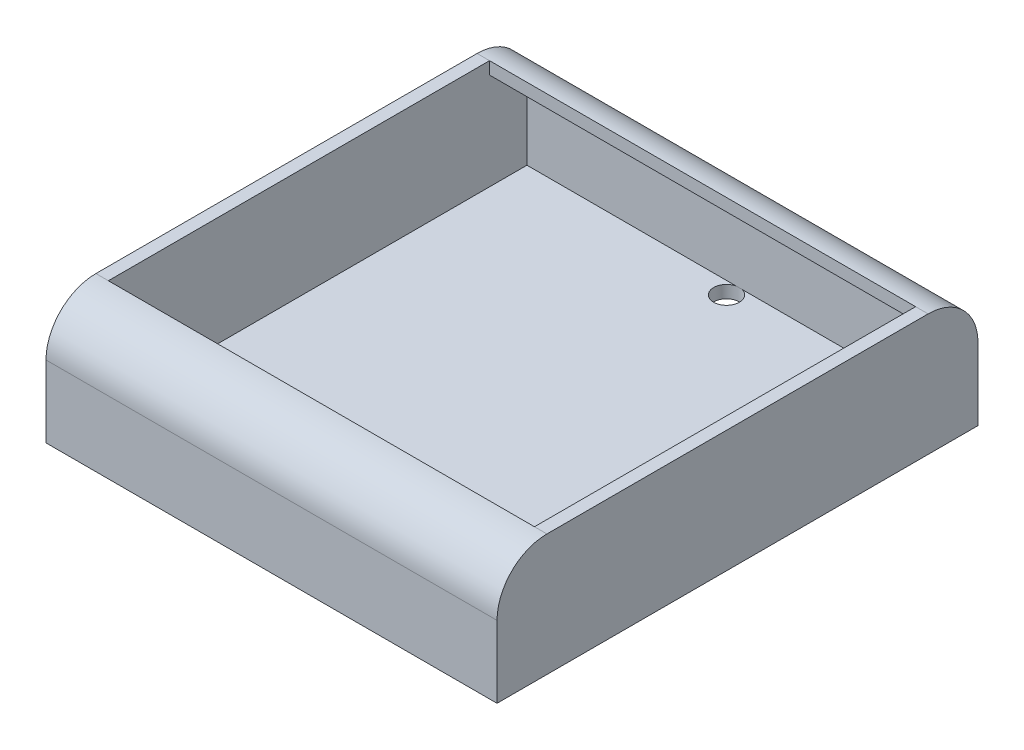
ISO-10303-21;
HEADER;
FILE_DESCRIPTION(('STEP AP214'),'2;1');
FILE_NAME('part.step','',(''),(''),'','','');
FILE_SCHEMA(('AUTOMOTIVE_DESIGN { 1 0 10303 214 1 1 1 1 }'));
ENDSEC;
DATA;
#1=APPLICATION_CONTEXT('core data for automotive mechanical design processes');
#2=APPLICATION_PROTOCOL_DEFINITION('international standard','automotive_design',2000,#1);
#3=PRODUCT_CONTEXT('',#1,'mechanical');
#4=PRODUCT('Part','Part','',(#3));
#5=PRODUCT_RELATED_PRODUCT_CATEGORY('part','',(#4));
#6=PRODUCT_DEFINITION_FORMATION('','',#4);
#7=PRODUCT_DEFINITION_CONTEXT('part definition',#1,'design');
#8=PRODUCT_DEFINITION('design','',#6,#7);
#9=PRODUCT_DEFINITION_SHAPE('','',#8);
#10=(LENGTH_UNIT() NAMED_UNIT(*) SI_UNIT(.MILLI.,.METRE.));
#11=(NAMED_UNIT(*) PLANE_ANGLE_UNIT() SI_UNIT($,.RADIAN.));
#12=(NAMED_UNIT(*) SI_UNIT($,.STERADIAN.) SOLID_ANGLE_UNIT());
#13=UNCERTAINTY_MEASURE_WITH_UNIT(LENGTH_MEASURE(1.E-05),#10,'distance_accuracy_value','');
#14=(GEOMETRIC_REPRESENTATION_CONTEXT(3) GLOBAL_UNCERTAINTY_ASSIGNED_CONTEXT((#13)) GLOBAL_UNIT_ASSIGNED_CONTEXT((#10,
#11,#12)) REPRESENTATION_CONTEXT('',''));
#15=CARTESIAN_POINT('',(0.,0.,0.));
#16=DIRECTION('',(0.,0.,1.));
#17=DIRECTION('',(1.,0.,0.));
#18=AXIS2_PLACEMENT_3D('',#15,#16,#17);
#19=CARTESIAN_POINT('',(0.,1.5875,0.));
#20=DIRECTION('',(0.,1.,0.));
#21=DIRECTION('',(0.,0.,1.));
#22=AXIS2_PLACEMENT_3D('',#19,#20,#21);
#23=PLANE('',#22);
#24=CARTESIAN_POINT('',(28.575,1.5875,58.039));
#25=DIRECTION('',(0.,1.,0.));
#26=DIRECTION('',(0.,0.,1.));
#27=AXIS2_PLACEMENT_3D('',#24,#25,#26);
#28=CIRCLE('',#27,1.63194999999999);
#29=CARTESIAN_POINT('',(28.9532916236185,1.5875,59.6265));
#30=VERTEX_POINT('',#29);
#31=CARTESIAN_POINT('',(28.1967083763815,1.5875,59.6265));
#32=VERTEX_POINT('',#31);
#33=EDGE_CURVE('E55',#30,#32,#28,.T.);
#34=ORIENTED_EDGE('',*,*,#33,.F.);
#35=DIRECTION('',(1.,0.,0.));
#36=VECTOR('',#35,1.);
#37=CARTESIAN_POINT('',(-15.2876826971912,1.5875,59.6265));
#38=LINE('',#37,#36);
#39=CARTESIAN_POINT('',(55.8165,1.5875,59.6265));
#40=VERTEX_POINT('',#39);
#41=EDGE_CURVE('E162',#30,#40,#38,.T.);
#42=ORIENTED_EDGE('',*,*,#41,.T.);
#43=DIRECTION('',(0.,0.,-1.));
#44=VECTOR('',#43,1.);
#45=CARTESIAN_POINT('',(55.8165,1.5875,61.214));
#46=LINE('',#45,#44);
#47=CARTESIAN_POINT('',(55.8165,1.5875,1.58750000000003));
#48=VERTEX_POINT('',#47);
#49=EDGE_CURVE('E217',#40,#48,#46,.T.);
#50=ORIENTED_EDGE('',*,*,#49,.T.);
#51=DIRECTION('',(1.,0.,0.));
#52=VECTOR('',#51,1.);
#53=CARTESIAN_POINT('',(-15.2876826971912,1.5875,1.58750000000001));
#54=LINE('',#53,#52);
#55=CARTESIAN_POINT('',(28.9532916236186,1.5875,1.5875));
#56=VERTEX_POINT('',#55);
#57=EDGE_CURVE('E207',#56,#48,#54,.T.);
#58=ORIENTED_EDGE('',*,*,#57,.F.);
#59=CARTESIAN_POINT('',(28.575,1.5875,3.175));
#60=DIRECTION('',(0.,1.,0.));
#61=DIRECTION('',(0.,0.,1.));
#62=AXIS2_PLACEMENT_3D('',#59,#60,#61);
#63=CIRCLE('',#62,1.63194999999999);
#64=CARTESIAN_POINT('',(28.1967083763815,1.5875,1.5875));
#65=VERTEX_POINT('',#64);
#66=EDGE_CURVE('E318',#65,#56,#63,.T.);
#67=ORIENTED_EDGE('',*,*,#66,.F.);
#68=CARTESIAN_POINT('',(1.5875,1.5875,1.58750000000001));
#69=VERTEX_POINT('',#68);
#70=EDGE_CURVE('E208',#69,#65,#54,.T.);
#71=ORIENTED_EDGE('',*,*,#70,.F.);
#72=DIRECTION('',(0.,0.,1.));
#73=VECTOR('',#72,1.);
#74=CARTESIAN_POINT('',(1.5875,1.5875,0.));
#75=LINE('',#74,#73);
#76=CARTESIAN_POINT('',(1.58750000000001,1.5875,59.6265));
#77=VERTEX_POINT('',#76);
#78=EDGE_CURVE('E290',#69,#77,#75,.T.);
#79=ORIENTED_EDGE('',*,*,#78,.T.);
#80=EDGE_CURVE('E161',#77,#32,#38,.T.);
#81=ORIENTED_EDGE('',*,*,#80,.T.);
#82=EDGE_LOOP('',(#34,#42,#50,#58,#67,#71,#79,#81));
#83=FACE_BOUND('',#82,.T.);
#84=ADVANCED_FACE('F41',(#83),#23,.T.);
#85=CARTESIAN_POINT('',(55.8165,9.144,54.864));
#86=DIRECTION('',(1.,0.,0.));
#87=DIRECTION('',(0.,0.,-1.));
#88=AXIS2_PLACEMENT_3D('',#85,#86,#87);
#89=PLANE('',#88);
#90=ORIENTED_EDGE('',*,*,#49,.F.);
#91=DIRECTION('',(0.,1.,0.));
#92=VECTOR('',#91,1.);
#93=CARTESIAN_POINT('',(55.8165,0.,59.6265));
#94=LINE('',#93,#92);
#95=CARTESIAN_POINT('',(55.8165,9.144,59.6265));
#96=VERTEX_POINT('',#95);
#97=EDGE_CURVE('E174',#40,#96,#94,.T.);
#98=ORIENTED_EDGE('',*,*,#97,.T.);
#99=CARTESIAN_POINT('',(55.8165,9.144,54.864));
#100=DIRECTION('',(-1.,0.,0.));
#101=DIRECTION('',(0.,0.,1.));
#102=AXIS2_PLACEMENT_3D('',#99,#100,#101);
#103=CIRCLE('',#102,4.7625);
#104=CARTESIAN_POINT('',(55.8165,13.9065,54.864));
#105=VERTEX_POINT('',#104);
#106=EDGE_CURVE('E291',#96,#105,#103,.T.);
#107=ORIENTED_EDGE('',*,*,#106,.T.);
#108=DIRECTION('',(0.,1.,0.));
#109=VECTOR('',#108,1.);
#110=CARTESIAN_POINT('',(55.8165,0.,54.864));
#111=LINE('',#110,#109);
#112=CARTESIAN_POINT('',(55.8165,15.494,54.864));
#113=VERTEX_POINT('',#112);
#114=EDGE_CURVE('E297',#105,#113,#111,.T.);
#115=ORIENTED_EDGE('',*,*,#114,.T.);
#116=DIRECTION('',(0.,0.,1.));
#117=VECTOR('',#116,1.);
#118=CARTESIAN_POINT('',(55.8165,15.494,54.864));
#119=LINE('',#118,#117);
#120=CARTESIAN_POINT('',(55.8165,15.494,6.34999999999999));
#121=VERTEX_POINT('',#120);
#122=EDGE_CURVE('E219',#121,#113,#119,.T.);
#123=ORIENTED_EDGE('',*,*,#122,.F.);
#124=DIRECTION('',(0.,1.,0.));
#125=VECTOR('',#124,1.);
#126=CARTESIAN_POINT('',(55.8165,1.24900090270336E-13,6.35000000000027));
#127=LINE('',#126,#125);
#128=CARTESIAN_POINT('',(55.8165,13.9065,6.34999999999999));
#129=VERTEX_POINT('',#128);
#130=EDGE_CURVE('E199',#129,#121,#127,.T.);
#131=ORIENTED_EDGE('',*,*,#130,.F.);
#132=CARTESIAN_POINT('',(55.8165,9.144,6.34999999999999));
#133=DIRECTION('',(-1.,0.,0.));
#134=DIRECTION('',(0.,0.,1.));
#135=AXIS2_PLACEMENT_3D('',#132,#133,#134);
#136=CIRCLE('',#135,4.7625);
#137=CARTESIAN_POINT('',(55.8165,9.144,1.58749999999999));
#138=VERTEX_POINT('',#137);
#139=EDGE_CURVE('E189',#129,#138,#136,.T.);
#140=ORIENTED_EDGE('',*,*,#139,.T.);
#141=DIRECTION('',(0.,-1.,0.));
#142=VECTOR('',#141,1.);
#143=CARTESIAN_POINT('',(55.8165,0.,1.58749999999998));
#144=LINE('',#143,#142);
#145=EDGE_CURVE('E202',#138,#48,#144,.T.);
#146=ORIENTED_EDGE('',*,*,#145,.T.);
#147=EDGE_LOOP('',(#90,#98,#107,#115,#123,#131,#140,#146));
#148=FACE_BOUND('',#147,.T.);
#149=ADVANCED_FACE('F312',(#148),#89,.F.);
#150=CARTESIAN_POINT('',(0.,1.5875,0.));
#151=DIRECTION('',(1.,0.,0.));
#152=DIRECTION('',(0.,0.,-1.));
#153=AXIS2_PLACEMENT_3D('',#150,#151,#152);
#154=PLANE('',#153);
#155=DIRECTION('',(0.,0.,1.));
#156=VECTOR('',#155,1.);
#157=CARTESIAN_POINT('',(0.,0.,0.));
#158=LINE('',#157,#156);
#159=CARTESIAN_POINT('',(0.,0.,0.));
#160=VERTEX_POINT('',#159);
#161=CARTESIAN_POINT('',(0.,0.,61.214));
#162=VERTEX_POINT('',#161);
#163=EDGE_CURVE('E234',#160,#162,#158,.T.);
#164=ORIENTED_EDGE('',*,*,#163,.T.);
#165=DIRECTION('',(0.,-1.,0.));
#166=VECTOR('',#165,1.);
#167=CARTESIAN_POINT('',(0.,1.5875,61.214));
#168=LINE('',#167,#166);
#169=CARTESIAN_POINT('',(0.,9.144,61.214));
#170=VERTEX_POINT('',#169);
#171=EDGE_CURVE('E12',#170,#162,#168,.T.);
#172=ORIENTED_EDGE('',*,*,#171,.F.);
#173=CARTESIAN_POINT('',(0.,9.144,54.864));
#174=DIRECTION('',(-1.,0.,0.));
#175=DIRECTION('',(0.,0.,1.));
#176=AXIS2_PLACEMENT_3D('',#173,#174,#175);
#177=CIRCLE('',#176,6.35);
#178=CARTESIAN_POINT('',(0.,15.494,54.864));
#179=VERTEX_POINT('',#178);
#180=EDGE_CURVE('E281',#170,#179,#177,.T.);
#181=ORIENTED_EDGE('',*,*,#180,.T.);
#182=DIRECTION('',(0.,0.,-1.));
#183=VECTOR('',#182,1.);
#184=CARTESIAN_POINT('',(0.,15.494,54.864));
#185=LINE('',#184,#183);
#186=CARTESIAN_POINT('',(0.,15.494,6.35));
#187=VERTEX_POINT('',#186);
#188=EDGE_CURVE('E273',#179,#187,#185,.T.);
#189=ORIENTED_EDGE('',*,*,#188,.T.);
#190=CARTESIAN_POINT('',(0.,9.144,6.35));
#191=DIRECTION('',(-1.,0.,0.));
#192=DIRECTION('',(0.,0.,1.));
#193=AXIS2_PLACEMENT_3D('',#190,#191,#192);
#194=CIRCLE('',#193,6.35);
#195=CARTESIAN_POINT('',(0.,9.144,0.));
#196=VERTEX_POINT('',#195);
#197=EDGE_CURVE('E271',#187,#196,#194,.T.);
#198=ORIENTED_EDGE('',*,*,#197,.T.);
#199=DIRECTION('',(0.,-1.,0.));
#200=VECTOR('',#199,1.);
#201=CARTESIAN_POINT('',(0.,1.5875,0.));
#202=LINE('',#201,#200);
#203=EDGE_CURVE('E249',#196,#160,#202,.T.);
#204=ORIENTED_EDGE('',*,*,#203,.T.);
#205=EDGE_LOOP('',(#164,#172,#181,#189,#198,#204));
#206=FACE_BOUND('',#205,.T.);
#207=ADVANCED_FACE('F43',(#206),#154,.F.);
#208=CARTESIAN_POINT('',(0.,1.5875,61.214));
#209=DIRECTION('',(0.,0.,-1.));
#210=DIRECTION('',(-1.,0.,0.));
#211=AXIS2_PLACEMENT_3D('',#208,#209,#210);
#212=PLANE('',#211);
#213=DIRECTION('',(1.,0.,0.));
#214=VECTOR('',#213,1.);
#215=CARTESIAN_POINT('',(0.,0.,61.214));
#216=LINE('',#215,#214);
#217=CARTESIAN_POINT('',(57.404,0.,61.214));
#218=VERTEX_POINT('',#217);
#219=EDGE_CURVE('E243',#162,#218,#216,.T.);
#220=ORIENTED_EDGE('',*,*,#219,.T.);
#221=DIRECTION('',(0.,-1.,0.));
#222=VECTOR('',#221,1.);
#223=CARTESIAN_POINT('',(57.404,1.5875,61.214));
#224=LINE('',#223,#222);
#225=CARTESIAN_POINT('',(57.404,9.144,61.214));
#226=VERTEX_POINT('',#225);
#227=EDGE_CURVE('E49',#226,#218,#224,.T.);
#228=ORIENTED_EDGE('',*,*,#227,.F.);
#229=DIRECTION('',(1.,0.,0.));
#230=VECTOR('',#229,1.);
#231=CARTESIAN_POINT('',(55.8165,9.144,61.214));
#232=LINE('',#231,#230);
#233=EDGE_CURVE('E231',#170,#226,#232,.T.);
#234=ORIENTED_EDGE('',*,*,#233,.F.);
#235=ORIENTED_EDGE('',*,*,#171,.T.);
#236=EDGE_LOOP('',(#220,#228,#234,#235));
#237=FACE_BOUND('',#236,.T.);
#238=ADVANCED_FACE('F348',(#237),#212,.F.);
#239=CARTESIAN_POINT('',(57.404,1.5875,0.));
#240=DIRECTION('',(-1.,0.,0.));
#241=DIRECTION('',(0.,0.,1.));
#242=AXIS2_PLACEMENT_3D('',#239,#240,#241);
#243=PLANE('',#242);
#244=DIRECTION('',(0.,0.,-1.));
#245=VECTOR('',#244,1.);
#246=CARTESIAN_POINT('',(57.404,0.,0.));
#247=LINE('',#246,#245);
#248=CARTESIAN_POINT('',(57.404,0.,0.));
#249=VERTEX_POINT('',#248);
#250=EDGE_CURVE('E245',#218,#249,#247,.T.);
#251=ORIENTED_EDGE('',*,*,#250,.T.);
#252=DIRECTION('',(0.,-1.,0.));
#253=VECTOR('',#252,1.);
#254=CARTESIAN_POINT('',(57.404,1.5875,0.));
#255=LINE('',#254,#253);
#256=CARTESIAN_POINT('',(57.404,9.144,0.));
#257=VERTEX_POINT('',#256);
#258=EDGE_CURVE('E252',#257,#249,#255,.T.);
#259=ORIENTED_EDGE('',*,*,#258,.F.);
#260=CARTESIAN_POINT('',(57.404,9.144,6.34999999999999));
#261=DIRECTION('',(1.,0.,0.));
#262=DIRECTION('',(0.,0.,1.));
#263=AXIS2_PLACEMENT_3D('',#260,#261,#262);
#264=CIRCLE('',#263,6.35);
#265=CARTESIAN_POINT('',(57.404,15.494,6.34999999999999));
#266=VERTEX_POINT('',#265);
#267=EDGE_CURVE('E216',#257,#266,#264,.T.);
#268=ORIENTED_EDGE('',*,*,#267,.T.);
#269=DIRECTION('',(0.,0.,1.));
#270=VECTOR('',#269,1.);
#271=CARTESIAN_POINT('',(57.404,15.494,54.864));
#272=LINE('',#271,#270);
#273=CARTESIAN_POINT('',(57.404,15.494,54.864));
#274=VERTEX_POINT('',#273);
#275=EDGE_CURVE('E226',#266,#274,#272,.T.);
#276=ORIENTED_EDGE('',*,*,#275,.T.);
#277=CARTESIAN_POINT('',(57.404,9.144,54.864));
#278=DIRECTION('',(1.,0.,0.));
#279=DIRECTION('',(0.,0.,-1.));
#280=AXIS2_PLACEMENT_3D('',#277,#278,#279);
#281=CIRCLE('',#280,6.35);
#282=EDGE_CURVE('E220',#274,#226,#281,.T.);
#283=ORIENTED_EDGE('',*,*,#282,.T.);
#284=ORIENTED_EDGE('',*,*,#227,.T.);
#285=EDGE_LOOP('',(#251,#259,#268,#276,#283,#284));
#286=FACE_BOUND('',#285,.T.);
#287=ADVANCED_FACE('F257',(#286),#243,.F.);
#288=CARTESIAN_POINT('',(0.,1.5875,0.));
#289=DIRECTION('',(0.,0.,1.));
#290=DIRECTION('',(1.,0.,0.));
#291=AXIS2_PLACEMENT_3D('',#288,#289,#290);
#292=PLANE('',#291);
#293=ORIENTED_EDGE('',*,*,#203,.F.);
#294=DIRECTION('',(1.,0.,0.));
#295=VECTOR('',#294,1.);
#296=CARTESIAN_POINT('',(55.8165,9.144,0.));
#297=LINE('',#296,#295);
#298=EDGE_CURVE('E223',#196,#257,#297,.T.);
#299=ORIENTED_EDGE('',*,*,#298,.T.);
#300=ORIENTED_EDGE('',*,*,#258,.T.);
#301=DIRECTION('',(-1.,0.,0.));
#302=VECTOR('',#301,1.);
#303=CARTESIAN_POINT('',(0.,0.,0.));
#304=LINE('',#303,#302);
#305=EDGE_CURVE('E247',#249,#160,#304,.T.);
#306=ORIENTED_EDGE('',*,*,#305,.T.);
#307=EDGE_LOOP('',(#293,#299,#300,#306));
#308=FACE_BOUND('',#307,.T.);
#309=ADVANCED_FACE('F266',(#308),#292,.F.);
#310=CARTESIAN_POINT('',(0.,0.,0.));
#311=DIRECTION('',(0.,1.,0.));
#312=DIRECTION('',(0.,0.,1.));
#313=AXIS2_PLACEMENT_3D('',#310,#311,#312);
#314=PLANE('',#313);
#315=CARTESIAN_POINT('',(28.575,0.,58.039));
#316=DIRECTION('',(0.,1.,0.));
#317=DIRECTION('',(0.,0.,1.));
#318=AXIS2_PLACEMENT_3D('',#315,#316,#317);
#319=CIRCLE('',#318,1.63194999999999);
#320=CARTESIAN_POINT('',(28.575,0.,59.67095));
#321=VERTEX_POINT('',#320);
#322=EDGE_CURVE('E170',#321,#321,#319,.T.);
#323=ORIENTED_EDGE('',*,*,#322,.T.);
#324=EDGE_LOOP('',(#323));
#325=FACE_BOUND('',#324,.T.);
#326=CARTESIAN_POINT('',(28.575,0.,3.175));
#327=DIRECTION('',(0.,1.,0.));
#328=DIRECTION('',(0.,0.,1.));
#329=AXIS2_PLACEMENT_3D('',#326,#327,#328);
#330=CIRCLE('',#329,1.63194999999999);
#331=CARTESIAN_POINT('',(28.575,0.,4.80694999999999));
#332=VERTEX_POINT('',#331);
#333=EDGE_CURVE('E287',#332,#332,#330,.T.);
#334=ORIENTED_EDGE('',*,*,#333,.T.);
#335=EDGE_LOOP('',(#334));
#336=FACE_BOUND('',#335,.T.);
#337=ORIENTED_EDGE('',*,*,#163,.F.);
#338=ORIENTED_EDGE('',*,*,#305,.F.);
#339=ORIENTED_EDGE('',*,*,#250,.F.);
#340=ORIENTED_EDGE('',*,*,#219,.F.);
#341=EDGE_LOOP('',(#337,#338,#339,#340));
#342=FACE_BOUND('',#341,.T.);
#343=ADVANCED_FACE('F264',(#325,#336,#342),#314,.F.);
#344=CARTESIAN_POINT('',(55.8165,9.144,54.864));
#345=DIRECTION('',(1.,0.,0.));
#346=DIRECTION('',(0.,0.,-1.));
#347=AXIS2_PLACEMENT_3D('',#344,#345,#346);
#348=CYLINDRICAL_SURFACE('',#347,6.35);
#349=ORIENTED_EDGE('',*,*,#282,.F.);
#350=DIRECTION('',(1.,0.,0.));
#351=VECTOR('',#350,1.);
#352=CARTESIAN_POINT('',(55.8165,15.494,54.864));
#353=LINE('',#352,#351);
#354=EDGE_CURVE('E235',#113,#274,#353,.T.);
#355=ORIENTED_EDGE('',*,*,#354,.F.);
#356=DIRECTION('',(1.,0.,0.));
#357=VECTOR('',#356,1.);
#358=CARTESIAN_POINT('',(-15.2876826971912,15.494,54.864));
#359=LINE('',#358,#357);
#360=CARTESIAN_POINT('',(1.58750000000001,15.494,54.864));
#361=VERTEX_POINT('',#360);
#362=EDGE_CURVE('E176',#361,#113,#359,.T.);
#363=ORIENTED_EDGE('',*,*,#362,.F.);
#364=DIRECTION('',(1.,0.,0.));
#365=VECTOR('',#364,1.);
#366=CARTESIAN_POINT('',(0.,15.494,54.864));
#367=LINE('',#366,#365);
#368=EDGE_CURVE('E279',#179,#361,#367,.T.);
#369=ORIENTED_EDGE('',*,*,#368,.F.);
#370=ORIENTED_EDGE('',*,*,#180,.F.);
#371=ORIENTED_EDGE('',*,*,#233,.T.);
#372=EDGE_LOOP('',(#349,#355,#363,#369,#370,#371));
#373=FACE_BOUND('',#372,.T.);
#374=ADVANCED_FACE('F332',(#373),#348,.T.);
#375=CARTESIAN_POINT('',(55.8165,15.494,54.864));
#376=DIRECTION('',(0.,1.,0.));
#377=DIRECTION('',(0.,0.,1.));
#378=AXIS2_PLACEMENT_3D('',#375,#376,#377);
#379=PLANE('',#378);
#380=ORIENTED_EDGE('',*,*,#275,.F.);
#381=DIRECTION('',(1.,0.,0.));
#382=VECTOR('',#381,1.);
#383=CARTESIAN_POINT('',(55.8165,15.494,6.34999999999999));
#384=LINE('',#383,#382);
#385=EDGE_CURVE('E237',#121,#266,#384,.T.);
#386=ORIENTED_EDGE('',*,*,#385,.F.);
#387=ORIENTED_EDGE('',*,*,#122,.T.);
#388=ORIENTED_EDGE('',*,*,#354,.T.);
#389=EDGE_LOOP('',(#380,#386,#387,#388));
#390=FACE_BOUND('',#389,.T.);
#391=ADVANCED_FACE('F347',(#390),#379,.T.);
#392=CARTESIAN_POINT('',(55.8165,9.144,6.34999999999999));
#393=DIRECTION('',(1.,0.,0.));
#394=DIRECTION('',(0.,0.,-1.));
#395=AXIS2_PLACEMENT_3D('',#392,#393,#394);
#396=CYLINDRICAL_SURFACE('',#395,6.35);
#397=ORIENTED_EDGE('',*,*,#267,.F.);
#398=ORIENTED_EDGE('',*,*,#298,.F.);
#399=ORIENTED_EDGE('',*,*,#197,.F.);
#400=DIRECTION('',(1.,0.,0.));
#401=VECTOR('',#400,1.);
#402=CARTESIAN_POINT('',(0.,15.494,6.35));
#403=LINE('',#402,#401);
#404=CARTESIAN_POINT('',(1.5875,15.494,6.35));
#405=VERTEX_POINT('',#404);
#406=EDGE_CURVE('E277',#187,#405,#403,.T.);
#407=ORIENTED_EDGE('',*,*,#406,.T.);
#408=DIRECTION('',(1.,0.,0.));
#409=VECTOR('',#408,1.);
#410=CARTESIAN_POINT('',(-15.2876826971912,15.494,6.35000000000001));
#411=LINE('',#410,#409);
#412=EDGE_CURVE('E211',#405,#121,#411,.T.);
#413=ORIENTED_EDGE('',*,*,#412,.T.);
#414=ORIENTED_EDGE('',*,*,#385,.T.);
#415=EDGE_LOOP('',(#397,#398,#399,#407,#413,#414));
#416=FACE_BOUND('',#415,.T.);
#417=ADVANCED_FACE('F338',(#416),#396,.T.);
#418=CARTESIAN_POINT('',(-15.2876826971912,9.144,6.35000000000001));
#419=DIRECTION('',(1.,0.,0.));
#420=DIRECTION('',(0.,0.,-1.));
#421=AXIS2_PLACEMENT_3D('',#418,#419,#420);
#422=CYLINDRICAL_SURFACE('',#421,4.7625);
#423=CARTESIAN_POINT('',(1.5875,9.144,6.35000000000001));
#424=DIRECTION('',(1.,0.,0.));
#425=DIRECTION('',(0.,0.,-1.));
#426=AXIS2_PLACEMENT_3D('',#423,#424,#425);
#427=CIRCLE('',#426,4.7625);
#428=CARTESIAN_POINT('',(1.5875,9.144,1.58750000000004));
#429=VERTEX_POINT('',#428);
#430=CARTESIAN_POINT('',(1.5875,13.9065,6.35000000000001));
#431=VERTEX_POINT('',#430);
#432=EDGE_CURVE('E193',#429,#431,#427,.T.);
#433=ORIENTED_EDGE('',*,*,#432,.F.);
#434=DIRECTION('',(1.,0.,0.));
#435=VECTOR('',#434,1.);
#436=CARTESIAN_POINT('',(-15.2876826971912,9.144,1.58750000000001));
#437=LINE('',#436,#435);
#438=EDGE_CURVE('E205',#429,#138,#437,.T.);
#439=ORIENTED_EDGE('',*,*,#438,.T.);
#440=ORIENTED_EDGE('',*,*,#139,.F.);
#441=DIRECTION('',(1.,0.,0.));
#442=VECTOR('',#441,1.);
#443=CARTESIAN_POINT('',(-15.2876826971912,13.9065,6.35000000000001));
#444=LINE('',#443,#442);
#445=EDGE_CURVE('E194',#431,#129,#444,.T.);
#446=ORIENTED_EDGE('',*,*,#445,.F.);
#447=EDGE_LOOP('',(#433,#439,#440,#446));
#448=FACE_BOUND('',#447,.T.);
#449=ADVANCED_FACE('F396',(#448),#422,.F.);
#450=CARTESIAN_POINT('',(-15.2876826971912,1.24900090270336E-13,6.35000000000029));
#451=DIRECTION('',(0.,0.,-1.));
#452=DIRECTION('',(0.,1.,0.));
#453=AXIS2_PLACEMENT_3D('',#450,#451,#452);
#454=PLANE('',#453);
#455=ORIENTED_EDGE('',*,*,#412,.F.);
#456=DIRECTION('',(0.,-1.,0.));
#457=VECTOR('',#456,1.);
#458=CARTESIAN_POINT('',(1.5875,1.24900090270336E-13,6.35000000000028));
#459=LINE('',#458,#457);
#460=EDGE_CURVE('E190',#405,#431,#459,.T.);
#461=ORIENTED_EDGE('',*,*,#460,.T.);
#462=ORIENTED_EDGE('',*,*,#445,.T.);
#463=ORIENTED_EDGE('',*,*,#130,.T.);
#464=EDGE_LOOP('',(#455,#461,#462,#463));
#465=FACE_BOUND('',#464,.T.);
#466=ADVANCED_FACE('F340',(#465),#454,.F.);
#467=CARTESIAN_POINT('',(-15.2876826971912,0.,1.5875));
#468=DIRECTION('',(0.,0.,1.));
#469=DIRECTION('',(0.,-1.,0.));
#470=AXIS2_PLACEMENT_3D('',#467,#468,#469);
#471=PLANE('',#470);
#472=DIRECTION('',(0.,1.,0.));
#473=VECTOR('',#472,1.);
#474=CARTESIAN_POINT('',(1.5875,0.,1.5875));
#475=LINE('',#474,#473);
#476=EDGE_CURVE('E196',#69,#429,#475,.T.);
#477=ORIENTED_EDGE('',*,*,#476,.F.);
#478=ORIENTED_EDGE('',*,*,#70,.T.);
#479=EDGE_CURVE('E212',#65,#56,#54,.T.);
#480=ORIENTED_EDGE('',*,*,#479,.T.);
#481=ORIENTED_EDGE('',*,*,#57,.T.);
#482=ORIENTED_EDGE('',*,*,#145,.F.);
#483=ORIENTED_EDGE('',*,*,#438,.F.);
#484=EDGE_LOOP('',(#477,#478,#480,#481,#482,#483));
#485=FACE_BOUND('',#484,.T.);
#486=ADVANCED_FACE('F321',(#485),#471,.T.);
#487=CARTESIAN_POINT('',(-15.2876826971912,9.144,54.864));
#488=DIRECTION('',(1.,0.,0.));
#489=DIRECTION('',(0.,0.,-1.));
#490=AXIS2_PLACEMENT_3D('',#487,#488,#489);
#491=CYLINDRICAL_SURFACE('',#490,4.7625);
#492=CARTESIAN_POINT('',(1.58750000000001,9.144,54.864));
#493=DIRECTION('',(1.,0.,0.));
#494=DIRECTION('',(0.,0.,-1.));
#495=AXIS2_PLACEMENT_3D('',#492,#493,#494);
#496=CIRCLE('',#495,4.7625);
#497=CARTESIAN_POINT('',(1.58750000000001,13.9065,54.864));
#498=VERTEX_POINT('',#497);
#499=CARTESIAN_POINT('',(1.58750000000001,9.144,59.6265));
#500=VERTEX_POINT('',#499);
#501=EDGE_CURVE('E184',#498,#500,#496,.T.);
#502=ORIENTED_EDGE('',*,*,#501,.F.);
#503=DIRECTION('',(1.,0.,0.));
#504=VECTOR('',#503,1.);
#505=CARTESIAN_POINT('',(-15.2876826971912,13.9065,54.864));
#506=LINE('',#505,#504);
#507=EDGE_CURVE('E177',#498,#105,#506,.T.);
#508=ORIENTED_EDGE('',*,*,#507,.T.);
#509=ORIENTED_EDGE('',*,*,#106,.F.);
#510=DIRECTION('',(1.,0.,0.));
#511=VECTOR('',#510,1.);
#512=CARTESIAN_POINT('',(-15.2876826971912,9.144,59.6265));
#513=LINE('',#512,#511);
#514=EDGE_CURVE('E180',#500,#96,#513,.T.);
#515=ORIENTED_EDGE('',*,*,#514,.F.);
#516=EDGE_LOOP('',(#502,#508,#509,#515));
#517=FACE_BOUND('',#516,.T.);
#518=ADVANCED_FACE('F304',(#517),#491,.F.);
#519=CARTESIAN_POINT('',(-15.2876826971912,0.,59.6265));
#520=DIRECTION('',(0.,0.,-1.));
#521=DIRECTION('',(-1.,0.,0.));
#522=AXIS2_PLACEMENT_3D('',#519,#520,#521);
#523=PLANE('',#522);
#524=DIRECTION('',(0.,-1.,0.));
#525=VECTOR('',#524,1.);
#526=CARTESIAN_POINT('',(1.58750000000001,0.,59.6265));
#527=LINE('',#526,#525);
#528=EDGE_CURVE('E181',#500,#77,#527,.T.);
#529=ORIENTED_EDGE('',*,*,#528,.F.);
#530=ORIENTED_EDGE('',*,*,#514,.T.);
#531=ORIENTED_EDGE('',*,*,#97,.F.);
#532=ORIENTED_EDGE('',*,*,#41,.F.);
#533=EDGE_CURVE('E154',#32,#30,#38,.T.);
#534=ORIENTED_EDGE('',*,*,#533,.F.);
#535=ORIENTED_EDGE('',*,*,#80,.F.);
#536=EDGE_LOOP('',(#529,#530,#531,#532,#534,#535));
#537=FACE_BOUND('',#536,.T.);
#538=ADVANCED_FACE('F172',(#537),#523,.T.);
#539=CARTESIAN_POINT('',(-15.2876826971912,0.,54.864));
#540=DIRECTION('',(0.,0.,-1.));
#541=DIRECTION('',(-1.,0.,0.));
#542=AXIS2_PLACEMENT_3D('',#539,#540,#541);
#543=PLANE('',#542);
#544=DIRECTION('',(0.,-1.,0.));
#545=VECTOR('',#544,1.);
#546=CARTESIAN_POINT('',(1.58750000000001,0.,54.864));
#547=LINE('',#546,#545);
#548=EDGE_CURVE('E187',#361,#498,#547,.T.);
#549=ORIENTED_EDGE('',*,*,#548,.F.);
#550=ORIENTED_EDGE('',*,*,#362,.T.);
#551=ORIENTED_EDGE('',*,*,#114,.F.);
#552=ORIENTED_EDGE('',*,*,#507,.F.);
#553=EDGE_LOOP('',(#549,#550,#551,#552));
#554=FACE_BOUND('',#553,.T.);
#555=ADVANCED_FACE('F307',(#554),#543,.T.);
#556=CARTESIAN_POINT('',(1.58750000000001,9.144,54.864));
#557=DIRECTION('',(-1.,0.,0.));
#558=DIRECTION('',(0.,0.,1.));
#559=AXIS2_PLACEMENT_3D('',#556,#557,#558);
#560=PLANE('',#559);
#561=ORIENTED_EDGE('',*,*,#432,.T.);
#562=ORIENTED_EDGE('',*,*,#460,.F.);
#563=DIRECTION('',(0.,0.,-1.));
#564=VECTOR('',#563,1.);
#565=CARTESIAN_POINT('',(1.58750000000001,15.494,54.864));
#566=LINE('',#565,#564);
#567=EDGE_CURVE('E285',#361,#405,#566,.T.);
#568=ORIENTED_EDGE('',*,*,#567,.F.);
#569=ORIENTED_EDGE('',*,*,#548,.T.);
#570=ORIENTED_EDGE('',*,*,#501,.T.);
#571=ORIENTED_EDGE('',*,*,#528,.T.);
#572=ORIENTED_EDGE('',*,*,#78,.F.);
#573=ORIENTED_EDGE('',*,*,#476,.T.);
#574=EDGE_LOOP('',(#561,#562,#568,#569,#570,#571,#572,#573));
#575=FACE_BOUND('',#574,.T.);
#576=ADVANCED_FACE('F433',(#575),#560,.F.);
#577=CARTESIAN_POINT('',(0.,15.494,54.864));
#578=DIRECTION('',(0.,-1.,0.));
#579=DIRECTION('',(0.,0.,-1.));
#580=AXIS2_PLACEMENT_3D('',#577,#578,#579);
#581=PLANE('',#580);
#582=ORIENTED_EDGE('',*,*,#567,.T.);
#583=ORIENTED_EDGE('',*,*,#406,.F.);
#584=ORIENTED_EDGE('',*,*,#188,.F.);
#585=ORIENTED_EDGE('',*,*,#368,.T.);
#586=EDGE_LOOP('',(#582,#583,#584,#585));
#587=FACE_BOUND('',#586,.T.);
#588=ADVANCED_FACE('F335',(#587),#581,.F.);
#589=CARTESIAN_POINT('',(30.20695,1.5875,3.175));
#590=DIRECTION('',(0.,1.,0.));
#591=DIRECTION('',(0.,0.,1.));
#592=AXIS2_PLACEMENT_3D('',#589,#590,#591);
#593=PLANE('',#592);
#594=ORIENTED_EDGE('',*,*,#479,.F.);
#595=EDGE_CURVE('E62',#56,#65,#63,.T.);
#596=ORIENTED_EDGE('',*,*,#595,.F.);
#597=EDGE_LOOP('',(#594,#596));
#598=FACE_BOUND('',#597,.T.);
#599=ADVANCED_FACE('F322',(#598),#593,.F.);
#600=CARTESIAN_POINT('',(28.575,1.5875,3.175));
#601=DIRECTION('',(0.,1.,0.));
#602=DIRECTION('',(0.,0.,1.));
#603=AXIS2_PLACEMENT_3D('',#600,#601,#602);
#604=CYLINDRICAL_SURFACE('',#603,1.63194999999999);
#605=ORIENTED_EDGE('',*,*,#333,.F.);
#606=EDGE_LOOP('',(#605));
#607=FACE_BOUND('',#606,.T.);
#608=ORIENTED_EDGE('',*,*,#595,.T.);
#609=ORIENTED_EDGE('',*,*,#66,.T.);
#610=EDGE_LOOP('',(#608,#609));
#611=FACE_BOUND('',#610,.T.);
#612=ADVANCED_FACE('F324',(#607,#611),#604,.F.);
#613=CARTESIAN_POINT('',(30.20695,1.5875,58.039));
#614=DIRECTION('',(0.,1.,0.));
#615=DIRECTION('',(0.,0.,1.));
#616=AXIS2_PLACEMENT_3D('',#613,#614,#615);
#617=PLANE('',#616);
#618=ORIENTED_EDGE('',*,*,#533,.T.);
#619=EDGE_CURVE('E156',#32,#30,#28,.T.);
#620=ORIENTED_EDGE('',*,*,#619,.F.);
#621=EDGE_LOOP('',(#618,#620));
#622=FACE_BOUND('',#621,.T.);
#623=ADVANCED_FACE('F155',(#622),#617,.F.);
#624=CARTESIAN_POINT('',(28.575,1.5875,58.039));
#625=DIRECTION('',(0.,1.,0.));
#626=DIRECTION('',(0.,0.,1.));
#627=AXIS2_PLACEMENT_3D('',#624,#625,#626);
#628=CYLINDRICAL_SURFACE('',#627,1.63194999999999);
#629=ORIENTED_EDGE('',*,*,#322,.F.);
#630=EDGE_LOOP('',(#629));
#631=FACE_BOUND('',#630,.T.);
#632=ORIENTED_EDGE('',*,*,#33,.T.);
#633=ORIENTED_EDGE('',*,*,#619,.T.);
#634=EDGE_LOOP('',(#632,#633));
#635=FACE_BOUND('',#634,.T.);
#636=ADVANCED_FACE('F164',(#631,#635),#628,.F.);
#637=CLOSED_SHELL('',(#84,#149,#207,#238,#287,#309,#343,#374,#391,#417,#449,#466,#486,#518,#538,
#555,#576,#588,#599,#612,#623,#636));
#638=MANIFOLD_SOLID_BREP('B2',#637);
#639=ADVANCED_BREP_SHAPE_REPRESENTATION('',(#18,#638),#14);
#640=SHAPE_DEFINITION_REPRESENTATION(#9,#639);
ENDSEC;
END-ISO-10303-21;
